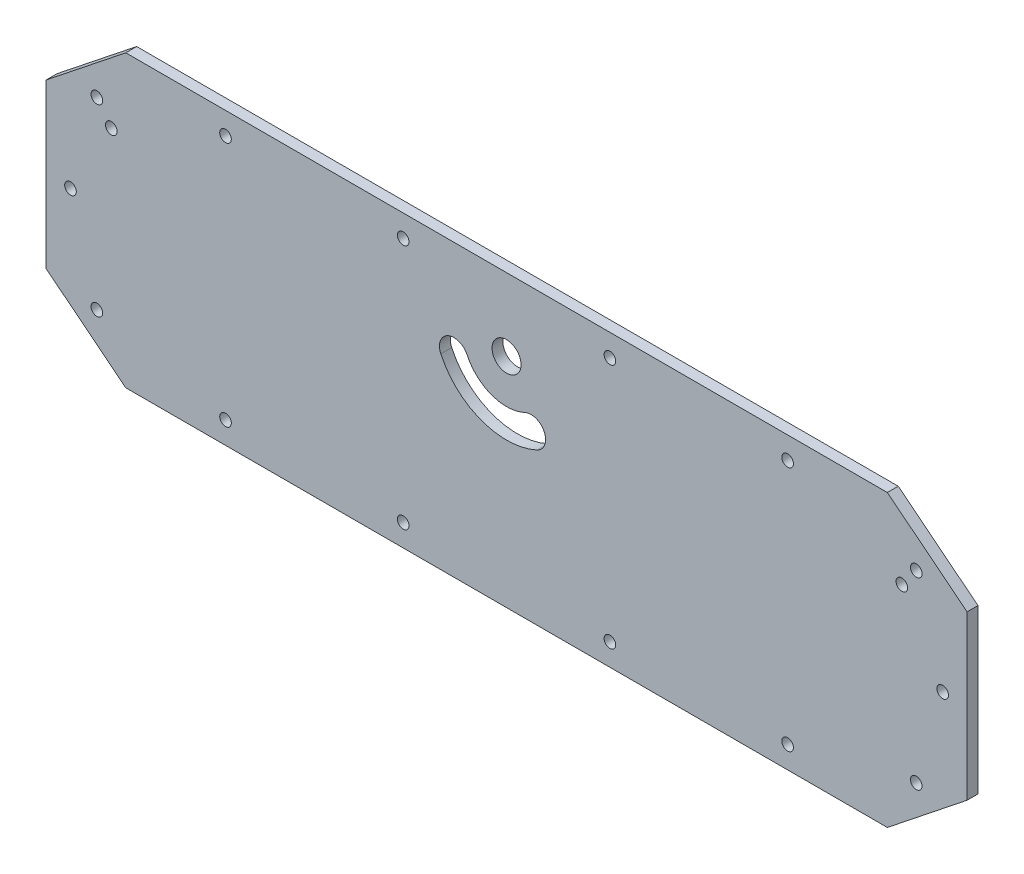
ISO-10303-21;
HEADER;
FILE_DESCRIPTION(('STEP AP214'),'2;1');
FILE_NAME('part.step','',(''),(''),'','','');
FILE_SCHEMA(('AUTOMOTIVE_DESIGN { 1 0 10303 214 1 1 1 1 }'));
ENDSEC;
DATA;
#1=APPLICATION_CONTEXT('core data for automotive mechanical design processes');
#2=APPLICATION_PROTOCOL_DEFINITION('international standard','automotive_design',2000,#1);
#3=PRODUCT_CONTEXT('',#1,'mechanical');
#4=PRODUCT('Part','Part','',(#3));
#5=PRODUCT_RELATED_PRODUCT_CATEGORY('part','',(#4));
#6=PRODUCT_DEFINITION_FORMATION('','',#4);
#7=PRODUCT_DEFINITION_CONTEXT('part definition',#1,'design');
#8=PRODUCT_DEFINITION('design','',#6,#7);
#9=PRODUCT_DEFINITION_SHAPE('','',#8);
#10=(LENGTH_UNIT() NAMED_UNIT(*) SI_UNIT(.MILLI.,.METRE.));
#11=(NAMED_UNIT(*) PLANE_ANGLE_UNIT() SI_UNIT($,.RADIAN.));
#12=(NAMED_UNIT(*) SI_UNIT($,.STERADIAN.) SOLID_ANGLE_UNIT());
#13=UNCERTAINTY_MEASURE_WITH_UNIT(LENGTH_MEASURE(1.E-05),#10,'distance_accuracy_value','');
#14=(GEOMETRIC_REPRESENTATION_CONTEXT(3) GLOBAL_UNCERTAINTY_ASSIGNED_CONTEXT((#13)) GLOBAL_UNIT_ASSIGNED_CONTEXT((#10,
#11,#12)) REPRESENTATION_CONTEXT('',''));
#15=CARTESIAN_POINT('',(0.,0.,0.));
#16=DIRECTION('',(0.,0.,1.));
#17=DIRECTION('',(1.,0.,0.));
#18=AXIS2_PLACEMENT_3D('',#15,#16,#17);
#19=CARTESIAN_POINT('',(-127.,40.,3.));
#20=DIRECTION('',(0.,0.,-1.));
#21=DIRECTION('',(-1.,0.,0.));
#22=AXIS2_PLACEMENT_3D('',#19,#20,#21);
#23=PLANE('',#22);
#24=CARTESIAN_POINT('',(-109.,20.,3.));
#25=DIRECTION('',(0.,0.,1.));
#26=DIRECTION('',(1.,0.,0.));
#27=AXIS2_PLACEMENT_3D('',#24,#25,#26);
#28=CIRCLE('',#27,1.6);
#29=CARTESIAN_POINT('',(-107.4,20.,3.));
#30=VERTEX_POINT('',#29);
#31=EDGE_CURVE('E149',#30,#30,#28,.T.);
#32=ORIENTED_EDGE('',*,*,#31,.F.);
#33=EDGE_LOOP('',(#32));
#34=FACE_BOUND('',#33,.T.);
#35=CARTESIAN_POINT('',(77.5,33.9,3.));
#36=DIRECTION('',(0.,0.,1.));
#37=DIRECTION('',(1.,0.,0.));
#38=AXIS2_PLACEMENT_3D('',#35,#36,#37);
#39=CIRCLE('',#38,1.60000000000001);
#40=CARTESIAN_POINT('',(79.1,33.9,3.));
#41=VERTEX_POINT('',#40);
#42=EDGE_CURVE('E159',#41,#41,#39,.T.);
#43=ORIENTED_EDGE('',*,*,#42,.F.);
#44=EDGE_LOOP('',(#43));
#45=FACE_BOUND('',#44,.T.);
#46=CARTESIAN_POINT('',(-28.5,33.9,3.));
#47=DIRECTION('',(0.,0.,1.));
#48=DIRECTION('',(1.,0.,0.));
#49=AXIS2_PLACEMENT_3D('',#46,#47,#48);
#50=CIRCLE('',#49,1.6);
#51=CARTESIAN_POINT('',(-26.9,33.9,3.));
#52=VERTEX_POINT('',#51);
#53=EDGE_CURVE('E171',#52,#52,#50,.T.);
#54=ORIENTED_EDGE('',*,*,#53,.F.);
#55=EDGE_LOOP('',(#54));
#56=FACE_BOUND('',#55,.T.);
#57=CARTESIAN_POINT('',(-112.98,25.35,3.));
#58=DIRECTION('',(0.,0.,1.));
#59=DIRECTION('',(1.,0.,0.));
#60=AXIS2_PLACEMENT_3D('',#57,#58,#59);
#61=CIRCLE('',#60,1.6);
#62=CARTESIAN_POINT('',(-111.38,25.35,3.));
#63=VERTEX_POINT('',#62);
#64=EDGE_CURVE('E183',#63,#63,#61,.T.);
#65=ORIENTED_EDGE('',*,*,#64,.F.);
#66=EDGE_LOOP('',(#65));
#67=FACE_BOUND('',#66,.T.);
#68=CARTESIAN_POINT('',(-112.98,-25.35,3.));
#69=DIRECTION('',(0.,0.,1.));
#70=DIRECTION('',(1.,0.,0.));
#71=AXIS2_PLACEMENT_3D('',#68,#69,#70);
#72=CIRCLE('',#71,1.6);
#73=CARTESIAN_POINT('',(-111.38,-25.35,3.));
#74=VERTEX_POINT('',#73);
#75=EDGE_CURVE('E195',#74,#74,#72,.T.);
#76=ORIENTED_EDGE('',*,*,#75,.F.);
#77=EDGE_LOOP('',(#76));
#78=FACE_BOUND('',#77,.T.);
#79=CARTESIAN_POINT('',(-28.5,-33.9,3.));
#80=DIRECTION('',(0.,0.,1.));
#81=DIRECTION('',(1.,0.,0.));
#82=AXIS2_PLACEMENT_3D('',#79,#80,#81);
#83=CIRCLE('',#82,1.6);
#84=CARTESIAN_POINT('',(-26.9,-33.9,3.));
#85=VERTEX_POINT('',#84);
#86=EDGE_CURVE('E207',#85,#85,#83,.T.);
#87=ORIENTED_EDGE('',*,*,#86,.F.);
#88=EDGE_LOOP('',(#87));
#89=FACE_BOUND('',#88,.T.);
#90=CARTESIAN_POINT('',(77.5,-33.9,3.));
#91=DIRECTION('',(0.,0.,1.));
#92=DIRECTION('',(1.,0.,0.));
#93=AXIS2_PLACEMENT_3D('',#90,#91,#92);
#94=CIRCLE('',#93,1.60000000000001);
#95=CARTESIAN_POINT('',(79.1,-33.9,3.));
#96=VERTEX_POINT('',#95);
#97=EDGE_CURVE('E219',#96,#96,#94,.T.);
#98=ORIENTED_EDGE('',*,*,#97,.F.);
#99=EDGE_LOOP('',(#98));
#100=FACE_BOUND('',#99,.T.);
#101=CARTESIAN_POINT('',(120.25,0.,3.));
#102=DIRECTION('',(0.,0.,1.));
#103=DIRECTION('',(1.,0.,0.));
#104=AXIS2_PLACEMENT_3D('',#101,#102,#103);
#105=CIRCLE('',#104,1.60000000000001);
#106=CARTESIAN_POINT('',(121.85,0.,3.));
#107=VERTEX_POINT('',#106);
#108=EDGE_CURVE('E231',#107,#107,#105,.T.);
#109=ORIENTED_EDGE('',*,*,#108,.F.);
#110=EDGE_LOOP('',(#109));
#111=FACE_BOUND('',#110,.T.);
#112=CARTESIAN_POINT('',(0.,20.,3.));
#113=DIRECTION('',(0.,0.,1.));
#114=DIRECTION('',(1.,0.,0.));
#115=AXIS2_PLACEMENT_3D('',#112,#113,#114);
#116=CIRCLE('',#115,4.00000000000002);
#117=CARTESIAN_POINT('',(4.00000000000002,20.,3.));
#118=VERTEX_POINT('',#117);
#119=EDGE_CURVE('E243',#118,#118,#116,.T.);
#120=ORIENTED_EDGE('',*,*,#119,.F.);
#121=EDGE_LOOP('',(#120));
#122=FACE_BOUND('',#121,.T.);
#123=DIRECTION('',(0.,-1.,0.));
#124=VECTOR('',#123,1.);
#125=CARTESIAN_POINT('',(-127.,-22.5,3.));
#126=LINE('',#125,#124);
#127=CARTESIAN_POINT('',(-127.,22.5,3.));
#128=VERTEX_POINT('',#127);
#129=CARTESIAN_POINT('',(-127.,-22.5,3.));
#130=VERTEX_POINT('',#129);
#131=EDGE_CURVE('E249',#128,#130,#126,.T.);
#132=ORIENTED_EDGE('',*,*,#131,.T.);
#133=DIRECTION('',(0.782601054175647,-0.62252356582154,0.));
#134=VECTOR('',#133,1.);
#135=CARTESIAN_POINT('',(-105.,-40.,3.));
#136=LINE('',#135,#134);
#137=CARTESIAN_POINT('',(-105.,-40.,3.));
#138=VERTEX_POINT('',#137);
#139=EDGE_CURVE('E252',#130,#138,#136,.T.);
#140=ORIENTED_EDGE('',*,*,#139,.T.);
#141=DIRECTION('',(1.,0.,0.));
#142=VECTOR('',#141,1.);
#143=CARTESIAN_POINT('',(105.,-40.,3.));
#144=LINE('',#143,#142);
#145=CARTESIAN_POINT('',(105.,-40.,3.));
#146=VERTEX_POINT('',#145);
#147=EDGE_CURVE('E255',#138,#146,#144,.T.);
#148=ORIENTED_EDGE('',*,*,#147,.T.);
#149=DIRECTION('',(0.782601054175648,0.622523565821539,0.));
#150=VECTOR('',#149,1.);
#151=CARTESIAN_POINT('',(127.,-22.5,3.));
#152=LINE('',#151,#150);
#153=CARTESIAN_POINT('',(127.,-22.5,3.));
#154=VERTEX_POINT('',#153);
#155=EDGE_CURVE('E257',#146,#154,#152,.T.);
#156=ORIENTED_EDGE('',*,*,#155,.T.);
#157=DIRECTION('',(0.,1.,0.));
#158=VECTOR('',#157,1.);
#159=CARTESIAN_POINT('',(127.,22.5,3.));
#160=LINE('',#159,#158);
#161=CARTESIAN_POINT('',(127.,22.5,3.));
#162=VERTEX_POINT('',#161);
#163=EDGE_CURVE('E259',#154,#162,#160,.T.);
#164=ORIENTED_EDGE('',*,*,#163,.T.);
#165=DIRECTION('',(-0.782601054175648,0.622523565821539,0.));
#166=VECTOR('',#165,1.);
#167=CARTESIAN_POINT('',(105.,40.,3.));
#168=LINE('',#167,#166);
#169=CARTESIAN_POINT('',(105.,40.,3.));
#170=VERTEX_POINT('',#169);
#171=EDGE_CURVE('E261',#162,#170,#168,.T.);
#172=ORIENTED_EDGE('',*,*,#171,.T.);
#173=DIRECTION('',(-1.,0.,0.));
#174=VECTOR('',#173,1.);
#175=CARTESIAN_POINT('',(-105.,40.,3.));
#176=LINE('',#175,#174);
#177=CARTESIAN_POINT('',(-105.,40.,3.));
#178=VERTEX_POINT('',#177);
#179=EDGE_CURVE('E263',#170,#178,#176,.T.);
#180=ORIENTED_EDGE('',*,*,#179,.T.);
#181=DIRECTION('',(-0.782601054175648,-0.622523565821539,0.));
#182=VECTOR('',#181,1.);
#183=CARTESIAN_POINT('',(-127.,22.5,3.));
#184=LINE('',#183,#182);
#185=EDGE_CURVE('E265',#178,#128,#184,.T.);
#186=ORIENTED_EDGE('',*,*,#185,.T.);
#187=EDGE_LOOP('',(#132,#140,#148,#156,#164,#172,#180,#186));
#188=FACE_BOUND('',#187,.T.);
#189=CARTESIAN_POINT('',(112.98,25.35,3.));
#190=DIRECTION('',(0.,0.,1.));
#191=DIRECTION('',(1.,0.,0.));
#192=AXIS2_PLACEMENT_3D('',#189,#190,#191);
#193=CIRCLE('',#192,1.6);
#194=CARTESIAN_POINT('',(114.58,25.35,3.));
#195=VERTEX_POINT('',#194);
#196=EDGE_CURVE('E237',#195,#195,#193,.T.);
#197=ORIENTED_EDGE('',*,*,#196,.F.);
#198=EDGE_LOOP('',(#197));
#199=FACE_BOUND('',#198,.T.);
#200=CARTESIAN_POINT('',(112.98,-25.35,3.));
#201=DIRECTION('',(0.,0.,1.));
#202=DIRECTION('',(1.,0.,0.));
#203=AXIS2_PLACEMENT_3D('',#200,#201,#202);
#204=CIRCLE('',#203,1.6);
#205=CARTESIAN_POINT('',(114.58,-25.35,3.));
#206=VERTEX_POINT('',#205);
#207=EDGE_CURVE('E225',#206,#206,#204,.T.);
#208=ORIENTED_EDGE('',*,*,#207,.F.);
#209=EDGE_LOOP('',(#208));
#210=FACE_BOUND('',#209,.T.);
#211=CARTESIAN_POINT('',(28.5,-33.9,3.));
#212=DIRECTION('',(0.,0.,1.));
#213=DIRECTION('',(1.,0.,0.));
#214=AXIS2_PLACEMENT_3D('',#211,#212,#213);
#215=CIRCLE('',#214,1.6);
#216=CARTESIAN_POINT('',(30.1,-33.9,3.));
#217=VERTEX_POINT('',#216);
#218=EDGE_CURVE('E213',#217,#217,#215,.T.);
#219=ORIENTED_EDGE('',*,*,#218,.F.);
#220=EDGE_LOOP('',(#219));
#221=FACE_BOUND('',#220,.T.);
#222=CARTESIAN_POINT('',(-77.5,-33.9,3.));
#223=DIRECTION('',(0.,0.,1.));
#224=DIRECTION('',(1.,0.,0.));
#225=AXIS2_PLACEMENT_3D('',#222,#223,#224);
#226=CIRCLE('',#225,1.60000000000001);
#227=CARTESIAN_POINT('',(-75.9,-33.9,3.));
#228=VERTEX_POINT('',#227);
#229=EDGE_CURVE('E201',#228,#228,#226,.T.);
#230=ORIENTED_EDGE('',*,*,#229,.F.);
#231=EDGE_LOOP('',(#230));
#232=FACE_BOUND('',#231,.T.);
#233=CARTESIAN_POINT('',(-120.25,0.,3.));
#234=DIRECTION('',(0.,0.,1.));
#235=DIRECTION('',(1.,0.,0.));
#236=AXIS2_PLACEMENT_3D('',#233,#234,#235);
#237=CIRCLE('',#236,1.60000000000001);
#238=CARTESIAN_POINT('',(-118.65,0.,3.));
#239=VERTEX_POINT('',#238);
#240=EDGE_CURVE('E189',#239,#239,#237,.T.);
#241=ORIENTED_EDGE('',*,*,#240,.F.);
#242=EDGE_LOOP('',(#241));
#243=FACE_BOUND('',#242,.T.);
#244=CARTESIAN_POINT('',(-77.5,33.9,3.));
#245=DIRECTION('',(0.,0.,1.));
#246=DIRECTION('',(1.,0.,0.));
#247=AXIS2_PLACEMENT_3D('',#244,#245,#246);
#248=CIRCLE('',#247,1.60000000000001);
#249=CARTESIAN_POINT('',(-75.9,33.9,3.));
#250=VERTEX_POINT('',#249);
#251=EDGE_CURVE('E177',#250,#250,#248,.T.);
#252=ORIENTED_EDGE('',*,*,#251,.F.);
#253=EDGE_LOOP('',(#252));
#254=FACE_BOUND('',#253,.T.);
#255=CARTESIAN_POINT('',(28.5,33.9,3.));
#256=DIRECTION('',(0.,0.,1.));
#257=DIRECTION('',(1.,0.,0.));
#258=AXIS2_PLACEMENT_3D('',#255,#256,#257);
#259=CIRCLE('',#258,1.6);
#260=CARTESIAN_POINT('',(30.1,33.9,3.));
#261=VERTEX_POINT('',#260);
#262=EDGE_CURVE('E165',#261,#261,#259,.T.);
#263=ORIENTED_EDGE('',*,*,#262,.F.);
#264=EDGE_LOOP('',(#263));
#265=FACE_BOUND('',#264,.T.);
#266=CARTESIAN_POINT('',(-14.5009245925864,13.2381078121488,3.));
#267=DIRECTION('',(0.,0.,1.));
#268=DIRECTION('',(1.,0.,0.));
#269=AXIS2_PLACEMENT_3D('',#266,#267,#268);
#270=CIRCLE('',#269,4.);
#271=CARTESIAN_POINT('',(-10.8756934444398,14.9285808591116,3.));
#272=VERTEX_POINT('',#271);
#273=CARTESIAN_POINT('',(-18.126155740733,11.547634765186,3.));
#274=VERTEX_POINT('',#273);
#275=EDGE_CURVE('E120',#272,#274,#270,.T.);
#276=ORIENTED_EDGE('',*,*,#275,.F.);
#277=CARTESIAN_POINT('',(0.,20.,3.));
#278=DIRECTION('',(0.,0.,-1.));
#279=DIRECTION('',(1.,0.,0.));
#280=AXIS2_PLACEMENT_3D('',#277,#278,#279);
#281=CIRCLE('',#280,12.);
#282=CARTESIAN_POINT('',(5.07141914088838,9.12430655556019,3.));
#283=VERTEX_POINT('',#282);
#284=EDGE_CURVE('E143',#283,#272,#281,.T.);
#285=ORIENTED_EDGE('',*,*,#284,.F.);
#286=CARTESIAN_POINT('',(6.76189218785118,5.49907540741359,3.));
#287=DIRECTION('',(0.,0.,1.));
#288=DIRECTION('',(1.,0.,0.));
#289=AXIS2_PLACEMENT_3D('',#286,#287,#288);
#290=CIRCLE('',#289,4.);
#291=CARTESIAN_POINT('',(8.45236523481396,1.87384425926699,3.));
#292=VERTEX_POINT('',#291);
#293=EDGE_CURVE('E141',#292,#283,#290,.T.);
#294=ORIENTED_EDGE('',*,*,#293,.F.);
#295=CARTESIAN_POINT('',(0.,20.,3.));
#296=DIRECTION('',(0.,0.,1.));
#297=DIRECTION('',(1.,0.,0.));
#298=AXIS2_PLACEMENT_3D('',#295,#296,#297);
#299=CIRCLE('',#298,20.);
#300=EDGE_CURVE('E128',#274,#292,#299,.T.);
#301=ORIENTED_EDGE('',*,*,#300,.F.);
#302=EDGE_LOOP('',(#276,#285,#294,#301));
#303=FACE_BOUND('',#302,.T.);
#304=CARTESIAN_POINT('',(109.,20.,3.));
#305=DIRECTION('',(0.,0.,1.));
#306=DIRECTION('',(1.,0.,0.));
#307=AXIS2_PLACEMENT_3D('',#304,#305,#306);
#308=CIRCLE('',#307,1.6);
#309=CARTESIAN_POINT('',(110.6,20.,3.));
#310=VERTEX_POINT('',#309);
#311=EDGE_CURVE('E458',#310,#310,#308,.T.);
#312=ORIENTED_EDGE('',*,*,#311,.F.);
#313=EDGE_LOOP('',(#312));
#314=FACE_BOUND('',#313,.T.);
#315=ADVANCED_FACE('F31',(#34,#45,#56,#67,#78,#89,#100,#111,#122,#188,#199,#210,#221,#232,#243,
#254,#265,#303,#314),#23,.F.);
#316=CARTESIAN_POINT('',(-127.,40.,0.));
#317=DIRECTION('',(0.,0.,-1.));
#318=DIRECTION('',(-1.,0.,0.));
#319=AXIS2_PLACEMENT_3D('',#316,#317,#318);
#320=PLANE('',#319);
#321=CARTESIAN_POINT('',(-109.,20.,0.));
#322=DIRECTION('',(0.,0.,1.));
#323=DIRECTION('',(1.,0.,0.));
#324=AXIS2_PLACEMENT_3D('',#321,#322,#323);
#325=CIRCLE('',#324,1.6);
#326=CARTESIAN_POINT('',(-107.4,20.,0.));
#327=VERTEX_POINT('',#326);
#328=EDGE_CURVE('E464',#327,#327,#325,.T.);
#329=ORIENTED_EDGE('',*,*,#328,.T.);
#330=EDGE_LOOP('',(#329));
#331=FACE_BOUND('',#330,.T.);
#332=CARTESIAN_POINT('',(77.5,33.9,0.));
#333=DIRECTION('',(0.,0.,1.));
#334=DIRECTION('',(1.,0.,0.));
#335=AXIS2_PLACEMENT_3D('',#332,#333,#334);
#336=CIRCLE('',#335,1.60000000000001);
#337=CARTESIAN_POINT('',(79.1,33.9,0.));
#338=VERTEX_POINT('',#337);
#339=EDGE_CURVE('E136',#338,#338,#336,.T.);
#340=ORIENTED_EDGE('',*,*,#339,.T.);
#341=EDGE_LOOP('',(#340));
#342=FACE_BOUND('',#341,.T.);
#343=CARTESIAN_POINT('',(-28.5,33.9,0.));
#344=DIRECTION('',(0.,0.,1.));
#345=DIRECTION('',(1.,0.,0.));
#346=AXIS2_PLACEMENT_3D('',#343,#344,#345);
#347=CIRCLE('',#346,1.6);
#348=CARTESIAN_POINT('',(-26.9,33.9,0.));
#349=VERTEX_POINT('',#348);
#350=EDGE_CURVE('E168',#349,#349,#347,.T.);
#351=ORIENTED_EDGE('',*,*,#350,.T.);
#352=EDGE_LOOP('',(#351));
#353=FACE_BOUND('',#352,.T.);
#354=CARTESIAN_POINT('',(-112.98,25.35,0.));
#355=DIRECTION('',(0.,0.,1.));
#356=DIRECTION('',(1.,0.,0.));
#357=AXIS2_PLACEMENT_3D('',#354,#355,#356);
#358=CIRCLE('',#357,1.6);
#359=CARTESIAN_POINT('',(-111.38,25.35,0.));
#360=VERTEX_POINT('',#359);
#361=EDGE_CURVE('E180',#360,#360,#358,.T.);
#362=ORIENTED_EDGE('',*,*,#361,.T.);
#363=EDGE_LOOP('',(#362));
#364=FACE_BOUND('',#363,.T.);
#365=CARTESIAN_POINT('',(-112.98,-25.35,0.));
#366=DIRECTION('',(0.,0.,1.));
#367=DIRECTION('',(1.,0.,0.));
#368=AXIS2_PLACEMENT_3D('',#365,#366,#367);
#369=CIRCLE('',#368,1.6);
#370=CARTESIAN_POINT('',(-111.38,-25.35,0.));
#371=VERTEX_POINT('',#370);
#372=EDGE_CURVE('E192',#371,#371,#369,.T.);
#373=ORIENTED_EDGE('',*,*,#372,.T.);
#374=EDGE_LOOP('',(#373));
#375=FACE_BOUND('',#374,.T.);
#376=CARTESIAN_POINT('',(-28.5,-33.9,0.));
#377=DIRECTION('',(0.,0.,1.));
#378=DIRECTION('',(1.,0.,0.));
#379=AXIS2_PLACEMENT_3D('',#376,#377,#378);
#380=CIRCLE('',#379,1.6);
#381=CARTESIAN_POINT('',(-26.9,-33.9,0.));
#382=VERTEX_POINT('',#381);
#383=EDGE_CURVE('E204',#382,#382,#380,.T.);
#384=ORIENTED_EDGE('',*,*,#383,.T.);
#385=EDGE_LOOP('',(#384));
#386=FACE_BOUND('',#385,.T.);
#387=CARTESIAN_POINT('',(77.5,-33.9,0.));
#388=DIRECTION('',(0.,0.,1.));
#389=DIRECTION('',(1.,0.,0.));
#390=AXIS2_PLACEMENT_3D('',#387,#388,#389);
#391=CIRCLE('',#390,1.60000000000001);
#392=CARTESIAN_POINT('',(79.1,-33.9,0.));
#393=VERTEX_POINT('',#392);
#394=EDGE_CURVE('E216',#393,#393,#391,.T.);
#395=ORIENTED_EDGE('',*,*,#394,.T.);
#396=EDGE_LOOP('',(#395));
#397=FACE_BOUND('',#396,.T.);
#398=CARTESIAN_POINT('',(120.25,0.,0.));
#399=DIRECTION('',(0.,0.,1.));
#400=DIRECTION('',(1.,0.,0.));
#401=AXIS2_PLACEMENT_3D('',#398,#399,#400);
#402=CIRCLE('',#401,1.60000000000001);
#403=CARTESIAN_POINT('',(121.85,0.,0.));
#404=VERTEX_POINT('',#403);
#405=EDGE_CURVE('E228',#404,#404,#402,.T.);
#406=ORIENTED_EDGE('',*,*,#405,.T.);
#407=EDGE_LOOP('',(#406));
#408=FACE_BOUND('',#407,.T.);
#409=CARTESIAN_POINT('',(0.,20.,0.));
#410=DIRECTION('',(0.,0.,1.));
#411=DIRECTION('',(1.,0.,0.));
#412=AXIS2_PLACEMENT_3D('',#409,#410,#411);
#413=CIRCLE('',#412,4.00000000000002);
#414=CARTESIAN_POINT('',(4.00000000000002,20.,0.));
#415=VERTEX_POINT('',#414);
#416=EDGE_CURVE('E240',#415,#415,#413,.T.);
#417=ORIENTED_EDGE('',*,*,#416,.T.);
#418=EDGE_LOOP('',(#417));
#419=FACE_BOUND('',#418,.T.);
#420=DIRECTION('',(0.,-1.,0.));
#421=VECTOR('',#420,1.);
#422=CARTESIAN_POINT('',(-127.,-22.5,0.));
#423=LINE('',#422,#421);
#424=CARTESIAN_POINT('',(-127.,22.5,0.));
#425=VERTEX_POINT('',#424);
#426=CARTESIAN_POINT('',(-127.,-22.5,0.));
#427=VERTEX_POINT('',#426);
#428=EDGE_CURVE('E246',#425,#427,#423,.T.);
#429=ORIENTED_EDGE('',*,*,#428,.F.);
#430=DIRECTION('',(-0.782601054175648,-0.622523565821539,0.));
#431=VECTOR('',#430,1.);
#432=CARTESIAN_POINT('',(-127.,22.5,0.));
#433=LINE('',#432,#431);
#434=CARTESIAN_POINT('',(-105.,40.,0.));
#435=VERTEX_POINT('',#434);
#436=EDGE_CURVE('E253',#435,#425,#433,.T.);
#437=ORIENTED_EDGE('',*,*,#436,.F.);
#438=DIRECTION('',(-1.,0.,0.));
#439=VECTOR('',#438,1.);
#440=CARTESIAN_POINT('',(-105.,40.,0.));
#441=LINE('',#440,#439);
#442=CARTESIAN_POINT('',(105.,40.,0.));
#443=VERTEX_POINT('',#442);
#444=EDGE_CURVE('E280',#443,#435,#441,.T.);
#445=ORIENTED_EDGE('',*,*,#444,.F.);
#446=DIRECTION('',(-0.782601054175648,0.622523565821539,0.));
#447=VECTOR('',#446,1.);
#448=CARTESIAN_POINT('',(105.,40.,0.));
#449=LINE('',#448,#447);
#450=CARTESIAN_POINT('',(127.,22.5,0.));
#451=VERTEX_POINT('',#450);
#452=EDGE_CURVE('E278',#451,#443,#449,.T.);
#453=ORIENTED_EDGE('',*,*,#452,.F.);
#454=DIRECTION('',(0.,1.,0.));
#455=VECTOR('',#454,1.);
#456=CARTESIAN_POINT('',(127.,22.5,0.));
#457=LINE('',#456,#455);
#458=CARTESIAN_POINT('',(127.,-22.5,0.));
#459=VERTEX_POINT('',#458);
#460=EDGE_CURVE('E276',#459,#451,#457,.T.);
#461=ORIENTED_EDGE('',*,*,#460,.F.);
#462=DIRECTION('',(0.782601054175648,0.622523565821539,0.));
#463=VECTOR('',#462,1.);
#464=CARTESIAN_POINT('',(127.,-22.5,0.));
#465=LINE('',#464,#463);
#466=CARTESIAN_POINT('',(105.,-40.,0.));
#467=VERTEX_POINT('',#466);
#468=EDGE_CURVE('E274',#467,#459,#465,.T.);
#469=ORIENTED_EDGE('',*,*,#468,.F.);
#470=DIRECTION('',(1.,0.,0.));
#471=VECTOR('',#470,1.);
#472=CARTESIAN_POINT('',(105.,-40.,0.));
#473=LINE('',#472,#471);
#474=CARTESIAN_POINT('',(-105.,-40.,0.));
#475=VERTEX_POINT('',#474);
#476=EDGE_CURVE('E272',#475,#467,#473,.T.);
#477=ORIENTED_EDGE('',*,*,#476,.F.);
#478=DIRECTION('',(0.782601054175647,-0.62252356582154,0.));
#479=VECTOR('',#478,1.);
#480=CARTESIAN_POINT('',(-105.,-40.,0.));
#481=LINE('',#480,#479);
#482=EDGE_CURVE('E270',#427,#475,#481,.T.);
#483=ORIENTED_EDGE('',*,*,#482,.F.);
#484=EDGE_LOOP('',(#429,#437,#445,#453,#461,#469,#477,#483));
#485=FACE_BOUND('',#484,.T.);
#486=CARTESIAN_POINT('',(112.98,25.35,0.));
#487=DIRECTION('',(0.,0.,1.));
#488=DIRECTION('',(1.,0.,0.));
#489=AXIS2_PLACEMENT_3D('',#486,#487,#488);
#490=CIRCLE('',#489,1.6);
#491=CARTESIAN_POINT('',(114.58,25.35,0.));
#492=VERTEX_POINT('',#491);
#493=EDGE_CURVE('E234',#492,#492,#490,.T.);
#494=ORIENTED_EDGE('',*,*,#493,.T.);
#495=EDGE_LOOP('',(#494));
#496=FACE_BOUND('',#495,.T.);
#497=CARTESIAN_POINT('',(112.98,-25.35,0.));
#498=DIRECTION('',(0.,0.,1.));
#499=DIRECTION('',(1.,0.,0.));
#500=AXIS2_PLACEMENT_3D('',#497,#498,#499);
#501=CIRCLE('',#500,1.6);
#502=CARTESIAN_POINT('',(114.58,-25.35,0.));
#503=VERTEX_POINT('',#502);
#504=EDGE_CURVE('E222',#503,#503,#501,.T.);
#505=ORIENTED_EDGE('',*,*,#504,.T.);
#506=EDGE_LOOP('',(#505));
#507=FACE_BOUND('',#506,.T.);
#508=CARTESIAN_POINT('',(28.5,-33.9,0.));
#509=DIRECTION('',(0.,0.,1.));
#510=DIRECTION('',(1.,0.,0.));
#511=AXIS2_PLACEMENT_3D('',#508,#509,#510);
#512=CIRCLE('',#511,1.6);
#513=CARTESIAN_POINT('',(30.1,-33.9,0.));
#514=VERTEX_POINT('',#513);
#515=EDGE_CURVE('E210',#514,#514,#512,.T.);
#516=ORIENTED_EDGE('',*,*,#515,.T.);
#517=EDGE_LOOP('',(#516));
#518=FACE_BOUND('',#517,.T.);
#519=CARTESIAN_POINT('',(-77.5,-33.9,0.));
#520=DIRECTION('',(0.,0.,1.));
#521=DIRECTION('',(1.,0.,0.));
#522=AXIS2_PLACEMENT_3D('',#519,#520,#521);
#523=CIRCLE('',#522,1.60000000000001);
#524=CARTESIAN_POINT('',(-75.9,-33.9,0.));
#525=VERTEX_POINT('',#524);
#526=EDGE_CURVE('E198',#525,#525,#523,.T.);
#527=ORIENTED_EDGE('',*,*,#526,.T.);
#528=EDGE_LOOP('',(#527));
#529=FACE_BOUND('',#528,.T.);
#530=CARTESIAN_POINT('',(-120.25,0.,0.));
#531=DIRECTION('',(0.,0.,1.));
#532=DIRECTION('',(1.,0.,0.));
#533=AXIS2_PLACEMENT_3D('',#530,#531,#532);
#534=CIRCLE('',#533,1.60000000000001);
#535=CARTESIAN_POINT('',(-118.65,0.,0.));
#536=VERTEX_POINT('',#535);
#537=EDGE_CURVE('E186',#536,#536,#534,.T.);
#538=ORIENTED_EDGE('',*,*,#537,.T.);
#539=EDGE_LOOP('',(#538));
#540=FACE_BOUND('',#539,.T.);
#541=CARTESIAN_POINT('',(-77.5,33.9,0.));
#542=DIRECTION('',(0.,0.,1.));
#543=DIRECTION('',(1.,0.,0.));
#544=AXIS2_PLACEMENT_3D('',#541,#542,#543);
#545=CIRCLE('',#544,1.60000000000001);
#546=CARTESIAN_POINT('',(-75.9,33.9,0.));
#547=VERTEX_POINT('',#546);
#548=EDGE_CURVE('E174',#547,#547,#545,.T.);
#549=ORIENTED_EDGE('',*,*,#548,.T.);
#550=EDGE_LOOP('',(#549));
#551=FACE_BOUND('',#550,.T.);
#552=CARTESIAN_POINT('',(28.5,33.9,0.));
#553=DIRECTION('',(0.,0.,1.));
#554=DIRECTION('',(1.,0.,0.));
#555=AXIS2_PLACEMENT_3D('',#552,#553,#554);
#556=CIRCLE('',#555,1.6);
#557=CARTESIAN_POINT('',(30.1,33.9,0.));
#558=VERTEX_POINT('',#557);
#559=EDGE_CURVE('E162',#558,#558,#556,.T.);
#560=ORIENTED_EDGE('',*,*,#559,.T.);
#561=EDGE_LOOP('',(#560));
#562=FACE_BOUND('',#561,.T.);
#563=CARTESIAN_POINT('',(0.,20.,0.));
#564=DIRECTION('',(0.,0.,-1.));
#565=DIRECTION('',(1.,0.,0.));
#566=AXIS2_PLACEMENT_3D('',#563,#564,#565);
#567=CIRCLE('',#566,12.);
#568=CARTESIAN_POINT('',(5.07141914088838,9.12430655556019,0.));
#569=VERTEX_POINT('',#568);
#570=CARTESIAN_POINT('',(-10.8756934444398,14.9285808591116,0.));
#571=VERTEX_POINT('',#570);
#572=EDGE_CURVE('E129',#569,#571,#567,.T.);
#573=ORIENTED_EDGE('',*,*,#572,.T.);
#574=CARTESIAN_POINT('',(-14.5009245925864,13.2381078121488,0.));
#575=DIRECTION('',(0.,0.,1.));
#576=DIRECTION('',(1.,0.,0.));
#577=AXIS2_PLACEMENT_3D('',#574,#575,#576);
#578=CIRCLE('',#577,4.);
#579=CARTESIAN_POINT('',(-18.126155740733,11.547634765186,0.));
#580=VERTEX_POINT('',#579);
#581=EDGE_CURVE('E54',#571,#580,#578,.T.);
#582=ORIENTED_EDGE('',*,*,#581,.T.);
#583=CARTESIAN_POINT('',(0.,20.,0.));
#584=DIRECTION('',(0.,0.,1.));
#585=DIRECTION('',(1.,0.,0.));
#586=AXIS2_PLACEMENT_3D('',#583,#584,#585);
#587=CIRCLE('',#586,20.);
#588=CARTESIAN_POINT('',(8.45236523481396,1.87384425926699,0.));
#589=VERTEX_POINT('',#588);
#590=EDGE_CURVE('E135',#580,#589,#587,.T.);
#591=ORIENTED_EDGE('',*,*,#590,.T.);
#592=CARTESIAN_POINT('',(6.76189218785118,5.49907540741359,0.));
#593=DIRECTION('',(0.,0.,1.));
#594=DIRECTION('',(1.,0.,0.));
#595=AXIS2_PLACEMENT_3D('',#592,#593,#594);
#596=CIRCLE('',#595,4.);
#597=EDGE_CURVE('E151',#589,#569,#596,.T.);
#598=ORIENTED_EDGE('',*,*,#597,.T.);
#599=EDGE_LOOP('',(#573,#582,#591,#598));
#600=FACE_BOUND('',#599,.T.);
#601=CARTESIAN_POINT('',(109.,20.,0.));
#602=DIRECTION('',(0.,0.,1.));
#603=DIRECTION('',(1.,0.,0.));
#604=AXIS2_PLACEMENT_3D('',#601,#602,#603);
#605=CIRCLE('',#604,1.6);
#606=CARTESIAN_POINT('',(110.6,20.,0.));
#607=VERTEX_POINT('',#606);
#608=EDGE_CURVE('E461',#607,#607,#605,.T.);
#609=ORIENTED_EDGE('',*,*,#608,.T.);
#610=EDGE_LOOP('',(#609));
#611=FACE_BOUND('',#610,.T.);
#612=ADVANCED_FACE('F310',(#331,#342,#353,#364,#375,#386,#397,#408,#419,#485,#496,#507,#518,
#529,#540,#551,#562,#600,#611),#320,.T.);
#613=CARTESIAN_POINT('',(-127.,-22.5,3.));
#614=DIRECTION('',(1.,0.,0.));
#615=DIRECTION('',(0.,0.,-1.));
#616=AXIS2_PLACEMENT_3D('',#613,#614,#615);
#617=PLANE('',#616);
#618=ORIENTED_EDGE('',*,*,#428,.T.);
#619=DIRECTION('',(0.,0.,-1.));
#620=VECTOR('',#619,1.);
#621=CARTESIAN_POINT('',(-127.,-22.5,3.));
#622=LINE('',#621,#620);
#623=EDGE_CURVE('E11',#130,#427,#622,.T.);
#624=ORIENTED_EDGE('',*,*,#623,.F.);
#625=ORIENTED_EDGE('',*,*,#131,.F.);
#626=DIRECTION('',(0.,0.,-1.));
#627=VECTOR('',#626,1.);
#628=CARTESIAN_POINT('',(-127.,22.5,3.));
#629=LINE('',#628,#627);
#630=EDGE_CURVE('E267',#128,#425,#629,.T.);
#631=ORIENTED_EDGE('',*,*,#630,.T.);
#632=EDGE_LOOP('',(#618,#624,#625,#631));
#633=FACE_BOUND('',#632,.T.);
#634=ADVANCED_FACE('F33',(#633),#617,.F.);
#635=CARTESIAN_POINT('',(-105.,-40.,3.));
#636=DIRECTION('',(0.62252356582154,0.782601054175647,0.));
#637=DIRECTION('',(-0.782601054175648,0.62252356582154,0.));
#638=AXIS2_PLACEMENT_3D('',#635,#636,#637);
#639=PLANE('',#638);
#640=ORIENTED_EDGE('',*,*,#482,.T.);
#641=DIRECTION('',(0.,0.,-1.));
#642=VECTOR('',#641,1.);
#643=CARTESIAN_POINT('',(-105.,-40.,3.));
#644=LINE('',#643,#642);
#645=EDGE_CURVE('E39',#138,#475,#644,.T.);
#646=ORIENTED_EDGE('',*,*,#645,.F.);
#647=ORIENTED_EDGE('',*,*,#139,.F.);
#648=ORIENTED_EDGE('',*,*,#623,.T.);
#649=EDGE_LOOP('',(#640,#646,#647,#648));
#650=FACE_BOUND('',#649,.T.);
#651=ADVANCED_FACE('F328',(#650),#639,.F.);
#652=CARTESIAN_POINT('',(105.,-40.,3.));
#653=DIRECTION('',(0.,1.,0.));
#654=DIRECTION('',(-1.,0.,0.));
#655=AXIS2_PLACEMENT_3D('',#652,#653,#654);
#656=PLANE('',#655);
#657=ORIENTED_EDGE('',*,*,#476,.T.);
#658=DIRECTION('',(0.,0.,-1.));
#659=VECTOR('',#658,1.);
#660=CARTESIAN_POINT('',(105.,-40.,3.));
#661=LINE('',#660,#659);
#662=EDGE_CURVE('E297',#146,#467,#661,.T.);
#663=ORIENTED_EDGE('',*,*,#662,.F.);
#664=ORIENTED_EDGE('',*,*,#147,.F.);
#665=ORIENTED_EDGE('',*,*,#645,.T.);
#666=EDGE_LOOP('',(#657,#663,#664,#665));
#667=FACE_BOUND('',#666,.T.);
#668=ADVANCED_FACE('F304',(#667),#656,.F.);
#669=CARTESIAN_POINT('',(127.,-22.5,3.));
#670=DIRECTION('',(-0.622523565821539,0.782601054175648,0.));
#671=DIRECTION('',(-0.782601054175649,-0.622523565821539,0.));
#672=AXIS2_PLACEMENT_3D('',#669,#670,#671);
#673=PLANE('',#672);
#674=ORIENTED_EDGE('',*,*,#468,.T.);
#675=DIRECTION('',(0.,0.,-1.));
#676=VECTOR('',#675,1.);
#677=CARTESIAN_POINT('',(127.,-22.5,3.));
#678=LINE('',#677,#676);
#679=EDGE_CURVE('E294',#154,#459,#678,.T.);
#680=ORIENTED_EDGE('',*,*,#679,.F.);
#681=ORIENTED_EDGE('',*,*,#155,.F.);
#682=ORIENTED_EDGE('',*,*,#662,.T.);
#683=EDGE_LOOP('',(#674,#680,#681,#682));
#684=FACE_BOUND('',#683,.T.);
#685=ADVANCED_FACE('F316',(#684),#673,.F.);
#686=CARTESIAN_POINT('',(127.,22.5,3.));
#687=DIRECTION('',(-1.,0.,0.));
#688=DIRECTION('',(0.,0.,1.));
#689=AXIS2_PLACEMENT_3D('',#686,#687,#688);
#690=PLANE('',#689);
#691=ORIENTED_EDGE('',*,*,#460,.T.);
#692=DIRECTION('',(0.,0.,-1.));
#693=VECTOR('',#692,1.);
#694=CARTESIAN_POINT('',(127.,22.5,3.));
#695=LINE('',#694,#693);
#696=EDGE_CURVE('E291',#162,#451,#695,.T.);
#697=ORIENTED_EDGE('',*,*,#696,.F.);
#698=ORIENTED_EDGE('',*,*,#163,.F.);
#699=ORIENTED_EDGE('',*,*,#679,.T.);
#700=EDGE_LOOP('',(#691,#697,#698,#699));
#701=FACE_BOUND('',#700,.T.);
#702=ADVANCED_FACE('F320',(#701),#690,.F.);
#703=CARTESIAN_POINT('',(105.,40.,3.));
#704=DIRECTION('',(-0.622523565821539,-0.782601054175649,0.));
#705=DIRECTION('',(0.782601054175649,-0.622523565821539,0.));
#706=AXIS2_PLACEMENT_3D('',#703,#704,#705);
#707=PLANE('',#706);
#708=ORIENTED_EDGE('',*,*,#452,.T.);
#709=DIRECTION('',(0.,0.,-1.));
#710=VECTOR('',#709,1.);
#711=CARTESIAN_POINT('',(105.,40.,3.));
#712=LINE('',#711,#710);
#713=EDGE_CURVE('E288',#170,#443,#712,.T.);
#714=ORIENTED_EDGE('',*,*,#713,.F.);
#715=ORIENTED_EDGE('',*,*,#171,.F.);
#716=ORIENTED_EDGE('',*,*,#696,.T.);
#717=EDGE_LOOP('',(#708,#714,#715,#716));
#718=FACE_BOUND('',#717,.T.);
#719=ADVANCED_FACE('F341',(#718),#707,.F.);
#720=CARTESIAN_POINT('',(-105.,40.,3.));
#721=DIRECTION('',(0.,-1.,0.));
#722=DIRECTION('',(1.,0.,0.));
#723=AXIS2_PLACEMENT_3D('',#720,#721,#722);
#724=PLANE('',#723);
#725=ORIENTED_EDGE('',*,*,#444,.T.);
#726=DIRECTION('',(0.,0.,-1.));
#727=VECTOR('',#726,1.);
#728=CARTESIAN_POINT('',(-105.,40.,3.));
#729=LINE('',#728,#727);
#730=EDGE_CURVE('E285',#178,#435,#729,.T.);
#731=ORIENTED_EDGE('',*,*,#730,.F.);
#732=ORIENTED_EDGE('',*,*,#179,.F.);
#733=ORIENTED_EDGE('',*,*,#713,.T.);
#734=EDGE_LOOP('',(#725,#731,#732,#733));
#735=FACE_BOUND('',#734,.T.);
#736=ADVANCED_FACE('F339',(#735),#724,.F.);
#737=CARTESIAN_POINT('',(-127.,22.5,3.));
#738=DIRECTION('',(0.622523565821539,-0.782601054175648,0.));
#739=DIRECTION('',(0.782601054175649,0.622523565821539,0.));
#740=AXIS2_PLACEMENT_3D('',#737,#738,#739);
#741=PLANE('',#740);
#742=ORIENTED_EDGE('',*,*,#436,.T.);
#743=ORIENTED_EDGE('',*,*,#630,.F.);
#744=ORIENTED_EDGE('',*,*,#185,.F.);
#745=ORIENTED_EDGE('',*,*,#730,.T.);
#746=EDGE_LOOP('',(#742,#743,#744,#745));
#747=FACE_BOUND('',#746,.T.);
#748=ADVANCED_FACE('F334',(#747),#741,.F.);
#749=CARTESIAN_POINT('',(0.,20.,3.));
#750=DIRECTION('',(0.,0.,-1.));
#751=DIRECTION('',(-1.,0.,0.));
#752=AXIS2_PLACEMENT_3D('',#749,#750,#751);
#753=CYLINDRICAL_SURFACE('',#752,4.00000000000002);
#754=ORIENTED_EDGE('',*,*,#119,.T.);
#755=EDGE_LOOP('',(#754));
#756=FACE_BOUND('',#755,.T.);
#757=ORIENTED_EDGE('',*,*,#416,.F.);
#758=EDGE_LOOP('',(#757));
#759=FACE_BOUND('',#758,.T.);
#760=ADVANCED_FACE('F361',(#756,#759),#753,.F.);
#761=CARTESIAN_POINT('',(112.98,25.35,3.));
#762=DIRECTION('',(0.,0.,-1.));
#763=DIRECTION('',(-1.,0.,0.));
#764=AXIS2_PLACEMENT_3D('',#761,#762,#763);
#765=CYLINDRICAL_SURFACE('',#764,1.6);
#766=ORIENTED_EDGE('',*,*,#196,.T.);
#767=EDGE_LOOP('',(#766));
#768=FACE_BOUND('',#767,.T.);
#769=ORIENTED_EDGE('',*,*,#493,.F.);
#770=EDGE_LOOP('',(#769));
#771=FACE_BOUND('',#770,.T.);
#772=ADVANCED_FACE('F368',(#768,#771),#765,.F.);
#773=CARTESIAN_POINT('',(120.25,0.,3.));
#774=DIRECTION('',(0.,0.,-1.));
#775=DIRECTION('',(-1.,0.,0.));
#776=AXIS2_PLACEMENT_3D('',#773,#774,#775);
#777=CYLINDRICAL_SURFACE('',#776,1.60000000000001);
#778=ORIENTED_EDGE('',*,*,#108,.T.);
#779=EDGE_LOOP('',(#778));
#780=FACE_BOUND('',#779,.T.);
#781=ORIENTED_EDGE('',*,*,#405,.F.);
#782=EDGE_LOOP('',(#781));
#783=FACE_BOUND('',#782,.T.);
#784=ADVANCED_FACE('F373',(#780,#783),#777,.F.);
#785=CARTESIAN_POINT('',(112.98,-25.35,3.));
#786=DIRECTION('',(0.,0.,-1.));
#787=DIRECTION('',(-1.,0.,0.));
#788=AXIS2_PLACEMENT_3D('',#785,#786,#787);
#789=CYLINDRICAL_SURFACE('',#788,1.6);
#790=ORIENTED_EDGE('',*,*,#207,.T.);
#791=EDGE_LOOP('',(#790));
#792=FACE_BOUND('',#791,.T.);
#793=ORIENTED_EDGE('',*,*,#504,.F.);
#794=EDGE_LOOP('',(#793));
#795=FACE_BOUND('',#794,.T.);
#796=ADVANCED_FACE('F383',(#792,#795),#789,.F.);
#797=CARTESIAN_POINT('',(77.5,-33.9,3.));
#798=DIRECTION('',(0.,0.,-1.));
#799=DIRECTION('',(-1.,0.,0.));
#800=AXIS2_PLACEMENT_3D('',#797,#798,#799);
#801=CYLINDRICAL_SURFACE('',#800,1.60000000000001);
#802=ORIENTED_EDGE('',*,*,#97,.T.);
#803=EDGE_LOOP('',(#802));
#804=FACE_BOUND('',#803,.T.);
#805=ORIENTED_EDGE('',*,*,#394,.F.);
#806=EDGE_LOOP('',(#805));
#807=FACE_BOUND('',#806,.T.);
#808=ADVANCED_FACE('F390',(#804,#807),#801,.F.);
#809=CARTESIAN_POINT('',(28.5,-33.9,3.));
#810=DIRECTION('',(0.,0.,-1.));
#811=DIRECTION('',(-1.,0.,0.));
#812=AXIS2_PLACEMENT_3D('',#809,#810,#811);
#813=CYLINDRICAL_SURFACE('',#812,1.6);
#814=ORIENTED_EDGE('',*,*,#218,.T.);
#815=EDGE_LOOP('',(#814));
#816=FACE_BOUND('',#815,.T.);
#817=ORIENTED_EDGE('',*,*,#515,.F.);
#818=EDGE_LOOP('',(#817));
#819=FACE_BOUND('',#818,.T.);
#820=ADVANCED_FACE('F394',(#816,#819),#813,.F.);
#821=CARTESIAN_POINT('',(-28.5,-33.9,3.));
#822=DIRECTION('',(0.,0.,-1.));
#823=DIRECTION('',(-1.,0.,0.));
#824=AXIS2_PLACEMENT_3D('',#821,#822,#823);
#825=CYLINDRICAL_SURFACE('',#824,1.6);
#826=ORIENTED_EDGE('',*,*,#86,.T.);
#827=EDGE_LOOP('',(#826));
#828=FACE_BOUND('',#827,.T.);
#829=ORIENTED_EDGE('',*,*,#383,.F.);
#830=EDGE_LOOP('',(#829));
#831=FACE_BOUND('',#830,.T.);
#832=ADVANCED_FACE('F398',(#828,#831),#825,.F.);
#833=CARTESIAN_POINT('',(-77.5,-33.9,3.));
#834=DIRECTION('',(0.,0.,-1.));
#835=DIRECTION('',(-1.,0.,0.));
#836=AXIS2_PLACEMENT_3D('',#833,#834,#835);
#837=CYLINDRICAL_SURFACE('',#836,1.60000000000001);
#838=ORIENTED_EDGE('',*,*,#229,.T.);
#839=EDGE_LOOP('',(#838));
#840=FACE_BOUND('',#839,.T.);
#841=ORIENTED_EDGE('',*,*,#526,.F.);
#842=EDGE_LOOP('',(#841));
#843=FACE_BOUND('',#842,.T.);
#844=ADVANCED_FACE('F402',(#840,#843),#837,.F.);
#845=CARTESIAN_POINT('',(-112.98,-25.35,3.));
#846=DIRECTION('',(0.,0.,-1.));
#847=DIRECTION('',(-1.,0.,0.));
#848=AXIS2_PLACEMENT_3D('',#845,#846,#847);
#849=CYLINDRICAL_SURFACE('',#848,1.6);
#850=ORIENTED_EDGE('',*,*,#75,.T.);
#851=EDGE_LOOP('',(#850));
#852=FACE_BOUND('',#851,.T.);
#853=ORIENTED_EDGE('',*,*,#372,.F.);
#854=EDGE_LOOP('',(#853));
#855=FACE_BOUND('',#854,.T.);
#856=ADVANCED_FACE('F406',(#852,#855),#849,.F.);
#857=CARTESIAN_POINT('',(-120.25,0.,3.));
#858=DIRECTION('',(0.,0.,-1.));
#859=DIRECTION('',(-1.,0.,0.));
#860=AXIS2_PLACEMENT_3D('',#857,#858,#859);
#861=CYLINDRICAL_SURFACE('',#860,1.60000000000001);
#862=ORIENTED_EDGE('',*,*,#240,.T.);
#863=EDGE_LOOP('',(#862));
#864=FACE_BOUND('',#863,.T.);
#865=ORIENTED_EDGE('',*,*,#537,.F.);
#866=EDGE_LOOP('',(#865));
#867=FACE_BOUND('',#866,.T.);
#868=ADVANCED_FACE('F410',(#864,#867),#861,.F.);
#869=CARTESIAN_POINT('',(-112.98,25.35,3.));
#870=DIRECTION('',(0.,0.,-1.));
#871=DIRECTION('',(-1.,0.,0.));
#872=AXIS2_PLACEMENT_3D('',#869,#870,#871);
#873=CYLINDRICAL_SURFACE('',#872,1.6);
#874=ORIENTED_EDGE('',*,*,#64,.T.);
#875=EDGE_LOOP('',(#874));
#876=FACE_BOUND('',#875,.T.);
#877=ORIENTED_EDGE('',*,*,#361,.F.);
#878=EDGE_LOOP('',(#877));
#879=FACE_BOUND('',#878,.T.);
#880=ADVANCED_FACE('F414',(#876,#879),#873,.F.);
#881=CARTESIAN_POINT('',(-77.5,33.9,3.));
#882=DIRECTION('',(0.,0.,-1.));
#883=DIRECTION('',(-1.,0.,0.));
#884=AXIS2_PLACEMENT_3D('',#881,#882,#883);
#885=CYLINDRICAL_SURFACE('',#884,1.60000000000001);
#886=ORIENTED_EDGE('',*,*,#251,.T.);
#887=EDGE_LOOP('',(#886));
#888=FACE_BOUND('',#887,.T.);
#889=ORIENTED_EDGE('',*,*,#548,.F.);
#890=EDGE_LOOP('',(#889));
#891=FACE_BOUND('',#890,.T.);
#892=ADVANCED_FACE('F418',(#888,#891),#885,.F.);
#893=CARTESIAN_POINT('',(-28.5,33.9,3.));
#894=DIRECTION('',(0.,0.,-1.));
#895=DIRECTION('',(-1.,0.,0.));
#896=AXIS2_PLACEMENT_3D('',#893,#894,#895);
#897=CYLINDRICAL_SURFACE('',#896,1.6);
#898=ORIENTED_EDGE('',*,*,#53,.T.);
#899=EDGE_LOOP('',(#898));
#900=FACE_BOUND('',#899,.T.);
#901=ORIENTED_EDGE('',*,*,#350,.F.);
#902=EDGE_LOOP('',(#901));
#903=FACE_BOUND('',#902,.T.);
#904=ADVANCED_FACE('F422',(#900,#903),#897,.F.);
#905=CARTESIAN_POINT('',(28.5,33.9,3.));
#906=DIRECTION('',(0.,0.,-1.));
#907=DIRECTION('',(-1.,0.,0.));
#908=AXIS2_PLACEMENT_3D('',#905,#906,#907);
#909=CYLINDRICAL_SURFACE('',#908,1.6);
#910=ORIENTED_EDGE('',*,*,#262,.T.);
#911=EDGE_LOOP('',(#910));
#912=FACE_BOUND('',#911,.T.);
#913=ORIENTED_EDGE('',*,*,#559,.F.);
#914=EDGE_LOOP('',(#913));
#915=FACE_BOUND('',#914,.T.);
#916=ADVANCED_FACE('F426',(#912,#915),#909,.F.);
#917=CARTESIAN_POINT('',(77.5,33.9,3.));
#918=DIRECTION('',(0.,0.,-1.));
#919=DIRECTION('',(-1.,0.,0.));
#920=AXIS2_PLACEMENT_3D('',#917,#918,#919);
#921=CYLINDRICAL_SURFACE('',#920,1.60000000000001);
#922=ORIENTED_EDGE('',*,*,#42,.T.);
#923=EDGE_LOOP('',(#922));
#924=FACE_BOUND('',#923,.T.);
#925=ORIENTED_EDGE('',*,*,#339,.F.);
#926=EDGE_LOOP('',(#925));
#927=FACE_BOUND('',#926,.T.);
#928=ADVANCED_FACE('F430',(#924,#927),#921,.F.);
#929=CARTESIAN_POINT('',(-14.5009245925864,13.2381078121488,3.));
#930=DIRECTION('',(0.,0.,-1.));
#931=DIRECTION('',(-1.,0.,0.));
#932=AXIS2_PLACEMENT_3D('',#929,#930,#931);
#933=CYLINDRICAL_SURFACE('',#932,4.);
#934=ORIENTED_EDGE('',*,*,#581,.F.);
#935=DIRECTION('',(0.,0.,-1.));
#936=VECTOR('',#935,1.);
#937=CARTESIAN_POINT('',(-10.8756934444398,14.9285808591116,3.));
#938=LINE('',#937,#936);
#939=EDGE_CURVE('E124',#272,#571,#938,.T.);
#940=ORIENTED_EDGE('',*,*,#939,.F.);
#941=ORIENTED_EDGE('',*,*,#275,.T.);
#942=DIRECTION('',(0.,0.,-1.));
#943=VECTOR('',#942,1.);
#944=CARTESIAN_POINT('',(-18.126155740733,11.547634765186,3.));
#945=LINE('',#944,#943);
#946=EDGE_CURVE('E123',#274,#580,#945,.T.);
#947=ORIENTED_EDGE('',*,*,#946,.T.);
#948=EDGE_LOOP('',(#934,#940,#941,#947));
#949=FACE_BOUND('',#948,.T.);
#950=ADVANCED_FACE('F122',(#949),#933,.F.);
#951=CARTESIAN_POINT('',(0.,20.,3.));
#952=DIRECTION('',(0.,0.,-1.));
#953=DIRECTION('',(-1.,0.,0.));
#954=AXIS2_PLACEMENT_3D('',#951,#952,#953);
#955=CYLINDRICAL_SURFACE('',#954,20.);
#956=ORIENTED_EDGE('',*,*,#590,.F.);
#957=ORIENTED_EDGE('',*,*,#946,.F.);
#958=ORIENTED_EDGE('',*,*,#300,.T.);
#959=DIRECTION('',(0.,0.,-1.));
#960=VECTOR('',#959,1.);
#961=CARTESIAN_POINT('',(8.45236523481396,1.87384425926699,3.));
#962=LINE('',#961,#960);
#963=EDGE_CURVE('E137',#292,#589,#962,.T.);
#964=ORIENTED_EDGE('',*,*,#963,.T.);
#965=EDGE_LOOP('',(#956,#957,#958,#964));
#966=FACE_BOUND('',#965,.T.);
#967=ADVANCED_FACE('F132',(#966),#955,.F.);
#968=CARTESIAN_POINT('',(6.76189218785118,5.49907540741359,3.));
#969=DIRECTION('',(0.,0.,-1.));
#970=DIRECTION('',(-1.,0.,0.));
#971=AXIS2_PLACEMENT_3D('',#968,#969,#970);
#972=CYLINDRICAL_SURFACE('',#971,4.);
#973=ORIENTED_EDGE('',*,*,#597,.F.);
#974=ORIENTED_EDGE('',*,*,#963,.F.);
#975=ORIENTED_EDGE('',*,*,#293,.T.);
#976=DIRECTION('',(0.,0.,-1.));
#977=VECTOR('',#976,1.);
#978=CARTESIAN_POINT('',(5.07141914088838,9.12430655556019,3.));
#979=LINE('',#978,#977);
#980=EDGE_CURVE('E46',#283,#569,#979,.T.);
#981=ORIENTED_EDGE('',*,*,#980,.T.);
#982=EDGE_LOOP('',(#973,#974,#975,#981));
#983=FACE_BOUND('',#982,.T.);
#984=ADVANCED_FACE('F439',(#983),#972,.F.);
#985=CARTESIAN_POINT('',(0.,20.,3.));
#986=DIRECTION('',(0.,0.,-1.));
#987=DIRECTION('',(-1.,0.,0.));
#988=AXIS2_PLACEMENT_3D('',#985,#986,#987);
#989=CYLINDRICAL_SURFACE('',#988,12.);
#990=ORIENTED_EDGE('',*,*,#572,.F.);
#991=ORIENTED_EDGE('',*,*,#980,.F.);
#992=ORIENTED_EDGE('',*,*,#284,.T.);
#993=ORIENTED_EDGE('',*,*,#939,.T.);
#994=EDGE_LOOP('',(#990,#991,#992,#993));
#995=FACE_BOUND('',#994,.T.);
#996=ADVANCED_FACE('F442',(#995),#989,.T.);
#997=CARTESIAN_POINT('',(-109.,20.,3.));
#998=DIRECTION('',(0.,0.,-1.));
#999=DIRECTION('',(-1.,0.,0.));
#1000=AXIS2_PLACEMENT_3D('',#997,#998,#999);
#1001=CYLINDRICAL_SURFACE('',#1000,1.6);
#1002=ORIENTED_EDGE('',*,*,#31,.T.);
#1003=EDGE_LOOP('',(#1002));
#1004=FACE_BOUND('',#1003,.T.);
#1005=ORIENTED_EDGE('',*,*,#328,.F.);
#1006=EDGE_LOOP('',(#1005));
#1007=FACE_BOUND('',#1006,.T.);
#1008=ADVANCED_FACE('F446',(#1004,#1007),#1001,.F.);
#1009=CARTESIAN_POINT('',(109.,20.,3.));
#1010=DIRECTION('',(0.,0.,-1.));
#1011=DIRECTION('',(-1.,0.,0.));
#1012=AXIS2_PLACEMENT_3D('',#1009,#1010,#1011);
#1013=CYLINDRICAL_SURFACE('',#1012,1.6);
#1014=ORIENTED_EDGE('',*,*,#311,.T.);
#1015=EDGE_LOOP('',(#1014));
#1016=FACE_BOUND('',#1015,.T.);
#1017=ORIENTED_EDGE('',*,*,#608,.F.);
#1018=EDGE_LOOP('',(#1017));
#1019=FACE_BOUND('',#1018,.T.);
#1020=ADVANCED_FACE('F449',(#1016,#1019),#1013,.F.);
#1021=CLOSED_SHELL('',(#315,#612,#634,#651,#668,#685,#702,#719,#736,#748,#760,#772,#784,#796,
#808,#820,#832,#844,#856,#868,#880,#892,#904,#916,#928,#950,#967,#984,#996,#1008,#1020));
#1022=MANIFOLD_SOLID_BREP('B2',#1021);
#1023=ADVANCED_BREP_SHAPE_REPRESENTATION('',(#18,#1022),#14);
#1024=SHAPE_DEFINITION_REPRESENTATION(#9,#1023);
ENDSEC;
END-ISO-10303-21;
